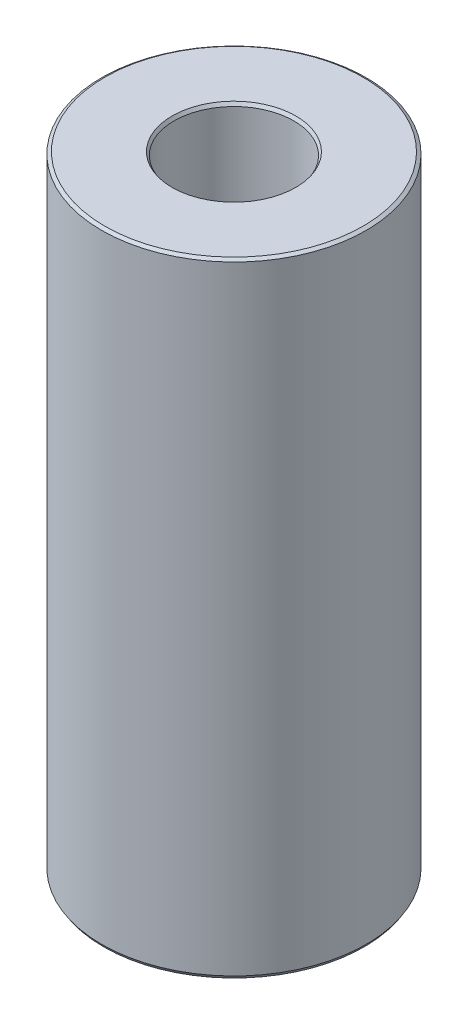
ISO-10303-21;
HEADER;
FILE_DESCRIPTION(('STEP AP214'),'2;1');
FILE_NAME('part.step','',(''),(''),'','','');
FILE_SCHEMA(('AUTOMOTIVE_DESIGN { 1 0 10303 214 1 1 1 1 }'));
ENDSEC;
DATA;
#1=APPLICATION_CONTEXT('core data for automotive mechanical design processes');
#2=APPLICATION_PROTOCOL_DEFINITION('international standard','automotive_design',2000,#1);
#3=PRODUCT_CONTEXT('',#1,'mechanical');
#4=PRODUCT('Part','Part','',(#3));
#5=PRODUCT_RELATED_PRODUCT_CATEGORY('part','',(#4));
#6=PRODUCT_DEFINITION_FORMATION('','',#4);
#7=PRODUCT_DEFINITION_CONTEXT('part definition',#1,'design');
#8=PRODUCT_DEFINITION('design','',#6,#7);
#9=PRODUCT_DEFINITION_SHAPE('','',#8);
#10=(LENGTH_UNIT() NAMED_UNIT(*) SI_UNIT(.MILLI.,.METRE.));
#11=(NAMED_UNIT(*) PLANE_ANGLE_UNIT() SI_UNIT($,.RADIAN.));
#12=(NAMED_UNIT(*) SI_UNIT($,.STERADIAN.) SOLID_ANGLE_UNIT());
#13=UNCERTAINTY_MEASURE_WITH_UNIT(LENGTH_MEASURE(1.E-05),#10,'distance_accuracy_value','');
#14=(GEOMETRIC_REPRESENTATION_CONTEXT(3) GLOBAL_UNCERTAINTY_ASSIGNED_CONTEXT((#13)) GLOBAL_UNIT_ASSIGNED_CONTEXT((#10,
#11,#12)) REPRESENTATION_CONTEXT('',''));
#15=CARTESIAN_POINT('',(0.,0.,0.));
#16=DIRECTION('',(0.,0.,1.));
#17=DIRECTION('',(1.,0.,0.));
#18=AXIS2_PLACEMENT_3D('',#15,#16,#17);
#19=CARTESIAN_POINT('',(0.,282.779953126256,0.));
#20=DIRECTION('',(0.,-1.,0.));
#21=DIRECTION('',(0.,0.,-1.));
#22=AXIS2_PLACEMENT_3D('',#19,#20,#21);
#23=CYLINDRICAL_SURFACE('',#22,60.);
#24=CARTESIAN_POINT('',(0.,1.45404582667269,0.));
#25=DIRECTION('',(0.,1.,0.));
#26=DIRECTION('',(0.,0.,1.));
#27=AXIS2_PLACEMENT_3D('',#24,#25,#26);
#28=CIRCLE('',#27,60.);
#29=CARTESIAN_POINT('',(0.,1.45404582667269,60.));
#30=VERTEX_POINT('',#29);
#31=EDGE_CURVE('E10',#30,#30,#28,.T.);
#32=ORIENTED_EDGE('',*,*,#31,.T.);
#33=EDGE_LOOP('',(#32));
#34=FACE_BOUND('',#33,.T.);
#35=CARTESIAN_POINT('',(0.,281.864798766686,0.));
#36=DIRECTION('',(0.,1.,0.));
#37=DIRECTION('',(0.,0.,1.));
#38=AXIS2_PLACEMENT_3D('',#35,#36,#37);
#39=CIRCLE('',#38,60.);
#40=CARTESIAN_POINT('',(0.,281.864798766686,60.));
#41=VERTEX_POINT('',#40);
#42=EDGE_CURVE('E50',#41,#41,#39,.F.);
#43=ORIENTED_EDGE('',*,*,#42,.T.);
#44=EDGE_LOOP('',(#43));
#45=FACE_BOUND('',#44,.T.);
#46=ADVANCED_FACE('F39',(#34,#45),#23,.T.);
#47=CARTESIAN_POINT('',(0.,282.779953126256,0.));
#48=DIRECTION('',(0.,1.,0.));
#49=DIRECTION('',(0.,0.,1.));
#50=AXIS2_PLACEMENT_3D('',#47,#48,#49);
#51=PLANE('',#50);
#52=CARTESIAN_POINT('',(0.,282.779953126256,0.));
#53=DIRECTION('',(0.,1.,0.));
#54=DIRECTION('',(0.,0.,1.));
#55=AXIS2_PLACEMENT_3D('',#52,#53,#54);
#56=CIRCLE('',#55,28.0710831644556);
#57=CARTESIAN_POINT('',(0.,282.779953126256,28.0710831644556));
#58=VERTEX_POINT('',#57);
#59=EDGE_CURVE('E58',#58,#58,#56,.F.);
#60=ORIENTED_EDGE('',*,*,#59,.T.);
#61=EDGE_LOOP('',(#60));
#62=FACE_BOUND('',#61,.T.);
#63=CARTESIAN_POINT('',(0.,282.779953126256,0.));
#64=DIRECTION('',(0.,1.,0.));
#65=DIRECTION('',(0.,0.,1.));
#66=AXIS2_PLACEMENT_3D('',#63,#64,#65);
#67=CIRCLE('',#66,58.5459541733271);
#68=CARTESIAN_POINT('',(0.,282.779953126256,58.5459541733271));
#69=VERTEX_POINT('',#68);
#70=EDGE_CURVE('E61',#69,#69,#67,.T.);
#71=ORIENTED_EDGE('',*,*,#70,.T.);
#72=EDGE_LOOP('',(#71));
#73=FACE_BOUND('',#72,.T.);
#74=ADVANCED_FACE('F88',(#62,#73),#51,.T.);
#75=CARTESIAN_POINT('',(0.,0.,0.));
#76=DIRECTION('',(0.,1.,0.));
#77=DIRECTION('',(0.,0.,1.));
#78=AXIS2_PLACEMENT_3D('',#75,#76,#77);
#79=PLANE('',#78);
#80=CARTESIAN_POINT('',(0.,0.,0.));
#81=DIRECTION('',(0.,1.,0.));
#82=DIRECTION('',(0.,0.,1.));
#83=AXIS2_PLACEMENT_3D('',#80,#81,#82);
#84=CIRCLE('',#83,28.6099746315583);
#85=CARTESIAN_POINT('',(0.,0.,28.6099746315583));
#86=VERTEX_POINT('',#85);
#87=EDGE_CURVE('E51',#86,#86,#84,.T.);
#88=ORIENTED_EDGE('',*,*,#87,.T.);
#89=EDGE_LOOP('',(#88));
#90=FACE_BOUND('',#89,.T.);
#91=CARTESIAN_POINT('',(0.,0.,0.));
#92=DIRECTION('',(0.,1.,0.));
#93=DIRECTION('',(0.,0.,1.));
#94=AXIS2_PLACEMENT_3D('',#91,#92,#93);
#95=CIRCLE('',#94,59.0848456404301);
#96=CARTESIAN_POINT('',(0.,0.,59.0848456404301));
#97=VERTEX_POINT('',#96);
#98=EDGE_CURVE('E54',#97,#97,#95,.F.);
#99=ORIENTED_EDGE('',*,*,#98,.T.);
#100=EDGE_LOOP('',(#99));
#101=FACE_BOUND('',#100,.T.);
#102=ADVANCED_FACE('F83',(#90,#101),#79,.F.);
#103=CARTESIAN_POINT('',(0.,282.779953126256,0.));
#104=DIRECTION('',(0.,-1.,0.));
#105=DIRECTION('',(0.,0.,-1.));
#106=AXIS2_PLACEMENT_3D('',#103,#104,#105);
#107=CYLINDRICAL_SURFACE('',#106,27.1559288048855);
#108=CARTESIAN_POINT('',(0.,281.325907299584,0.));
#109=DIRECTION('',(0.,1.,0.));
#110=DIRECTION('',(0.,0.,1.));
#111=AXIS2_PLACEMENT_3D('',#108,#109,#110);
#112=CIRCLE('',#111,27.1559288048855);
#113=CARTESIAN_POINT('',(0.,281.325907299584,27.1559288048855));
#114=VERTEX_POINT('',#113);
#115=EDGE_CURVE('E67',#114,#114,#112,.T.);
#116=ORIENTED_EDGE('',*,*,#115,.T.);
#117=EDGE_LOOP('',(#116));
#118=FACE_BOUND('',#117,.T.);
#119=CARTESIAN_POINT('',(0.,0.915154359570014,0.));
#120=DIRECTION('',(0.,1.,0.));
#121=DIRECTION('',(0.,0.,1.));
#122=AXIS2_PLACEMENT_3D('',#119,#120,#121);
#123=CIRCLE('',#122,27.1559288048855);
#124=CARTESIAN_POINT('',(0.,0.915154359570014,27.1559288048855));
#125=VERTEX_POINT('',#124);
#126=EDGE_CURVE('E69',#125,#125,#123,.F.);
#127=ORIENTED_EDGE('',*,*,#126,.T.);
#128=EDGE_LOOP('',(#127));
#129=FACE_BOUND('',#128,.T.);
#130=ADVANCED_FACE('F71',(#118,#129),#107,.F.);
#131=CARTESIAN_POINT('',(0.,281.325907299584,0.));
#132=DIRECTION('',(0.,1.,0.));
#133=DIRECTION('',(0.,0.,1.));
#134=AXIS2_PLACEMENT_3D('',#131,#132,#133);
#135=CONICAL_SURFACE('',#134,27.1559288048855,0.561746226699516);
#136=ORIENTED_EDGE('',*,*,#59,.F.);
#137=EDGE_LOOP('',(#136));
#138=FACE_BOUND('',#137,.T.);
#139=ORIENTED_EDGE('',*,*,#115,.F.);
#140=EDGE_LOOP('',(#139));
#141=FACE_BOUND('',#140,.T.);
#142=ADVANCED_FACE('F77',(#138,#141),#135,.F.);
#143=CARTESIAN_POINT('',(0.,0.,0.));
#144=DIRECTION('',(0.,-1.,0.));
#145=DIRECTION('',(0.,0.,-1.));
#146=AXIS2_PLACEMENT_3D('',#143,#144,#145);
#147=CONICAL_SURFACE('',#146,28.6099746315583,1.00905010009537);
#148=ORIENTED_EDGE('',*,*,#126,.F.);
#149=EDGE_LOOP('',(#148));
#150=FACE_BOUND('',#149,.T.);
#151=ORIENTED_EDGE('',*,*,#87,.F.);
#152=EDGE_LOOP('',(#151));
#153=FACE_BOUND('',#152,.T.);
#154=ADVANCED_FACE('F73',(#150,#153),#147,.F.);
#155=CARTESIAN_POINT('',(0.,1.45404582667269,0.));
#156=DIRECTION('',(0.,1.,0.));
#157=DIRECTION('',(0.,0.,1.));
#158=AXIS2_PLACEMENT_3D('',#155,#156,#157);
#159=CONICAL_SURFACE('',#158,60.,0.561746226699502);
#160=CARTESIAN_POINT('',(0.,0.,59.0848456404301));
#161=CARTESIAN_POINT('',(0.,0.0151463106945052,59.0943784983423));
#162=CARTESIAN_POINT('',(0.,0.030292621389013,59.1039113562545));
#163=CARTESIAN_POINT('',(0.,0.0605852427780286,59.1229770720788));
#164=CARTESIAN_POINT('',(0.,0.0757315534725364,59.132509929991));
#165=CARTESIAN_POINT('',(0.,0.10602417486155,59.1515756458154));
#166=CARTESIAN_POINT('',(0.,0.121170485556057,59.1611085037276));
#167=CARTESIAN_POINT('',(0.,0.151463106945071,59.180174219552));
#168=CARTESIAN_POINT('',(0.,0.166609417639579,59.1897070774641));
#169=CARTESIAN_POINT('',(0.,0.196902039028594,59.2087727932885));
#170=CARTESIAN_POINT('',(0.,0.2120483497231,59.2183056512007));
#171=CARTESIAN_POINT('',(0.,0.242340971112114,59.2373713670251));
#172=CARTESIAN_POINT('',(0.,0.257487281806622,59.2469042249373));
#173=CARTESIAN_POINT('',(0.,0.287779903195637,59.2659699407616));
#174=CARTESIAN_POINT('',(0.,0.302926213890143,59.2755027986738));
#175=CARTESIAN_POINT('',(0.,0.333218835279157,59.2945685144982));
#176=CARTESIAN_POINT('',(0.,0.348365145973665,59.3041013724104));
#177=CARTESIAN_POINT('',(0.,0.37865776736268,59.3231670882347));
#178=CARTESIAN_POINT('',(0.,0.393804078057187,59.3326999461469));
#179=CARTESIAN_POINT('',(0.,0.424096699446201,59.3517656619713));
#180=CARTESIAN_POINT('',(0.,0.439243010140707,59.3612985198835));
#181=CARTESIAN_POINT('',(0.,0.469535631529722,59.3803642357079));
#182=CARTESIAN_POINT('',(0.,0.48468194222423,59.38989709362));
#183=CARTESIAN_POINT('',(0.,0.514974563613244,59.4089628094444));
#184=CARTESIAN_POINT('',(0.,0.530120874307751,59.4184956673566));
#185=CARTESIAN_POINT('',(0.,0.560413495696765,59.437561383181));
#186=CARTESIAN_POINT('',(0.,0.575559806391273,59.4470942410932));
#187=CARTESIAN_POINT('',(0.,0.605852427780288,59.4661599569175));
#188=CARTESIAN_POINT('',(0.,0.620998738474794,59.4756928148297));
#189=CARTESIAN_POINT('',(0.,0.651291359863808,59.4947585306541));
#190=CARTESIAN_POINT('',(0.,0.666437670558316,59.5042913885663));
#191=CARTESIAN_POINT('',(0.,0.696730291947331,59.5233571043907));
#192=CARTESIAN_POINT('',(0.,0.711876602641838,59.5328899623029));
#193=CARTESIAN_POINT('',(0.,0.742169224030851,59.5519556781272));
#194=CARTESIAN_POINT('',(0.,0.757315534725358,59.5614885360394));
#195=CARTESIAN_POINT('',(0.,0.787608156114373,59.5805542518638));
#196=CARTESIAN_POINT('',(0.,0.802754466808881,59.590087109776));
#197=CARTESIAN_POINT('',(0.,0.833047088197895,59.6091528256003));
#198=CARTESIAN_POINT('',(0.,0.848193398892402,59.6186856835125));
#199=CARTESIAN_POINT('',(0.,0.878486020281416,59.6377513993369));
#200=CARTESIAN_POINT('',(0.,0.893632330975924,59.6472842572491));
#201=CARTESIAN_POINT('',(0.,0.923924952364939,59.6663499730735));
#202=CARTESIAN_POINT('',(0.,0.939071263059445,59.6758828309857));
#203=CARTESIAN_POINT('',(0.,0.969363884448459,59.69494854681));
#204=CARTESIAN_POINT('',(0.,0.984510195142967,59.7044814047222));
#205=CARTESIAN_POINT('',(0.,1.01480281653198,59.7235471205466));
#206=CARTESIAN_POINT('',(0.,1.02994912722649,59.7330799784588));
#207=CARTESIAN_POINT('',(0.,1.0602417486155,59.7521456942831));
#208=CARTESIAN_POINT('',(0.,1.07538805931001,59.7616785521953));
#209=CARTESIAN_POINT('',(0.,1.10568068069903,59.7807442680197));
#210=CARTESIAN_POINT('',(0.,1.12082699139353,59.7902771259319));
#211=CARTESIAN_POINT('',(0.,1.15111961278255,59.8093428417563));
#212=CARTESIAN_POINT('',(0.,1.16626592347705,59.8188756996685));
#213=CARTESIAN_POINT('',(0.,1.19655854486607,59.8379414154928));
#214=CARTESIAN_POINT('',(0.,1.21170485556058,59.847474273405));
#215=CARTESIAN_POINT('',(0.,1.24199747694959,59.8665399892294));
#216=CARTESIAN_POINT('',(0.,1.2571437876441,59.8760728471416));
#217=CARTESIAN_POINT('',(0.,1.28743640903311,59.8951385629659));
#218=CARTESIAN_POINT('',(0.,1.30258271972762,59.9046714208781));
#219=CARTESIAN_POINT('',(0.,1.33287534111663,59.9237371367025));
#220=CARTESIAN_POINT('',(0.,1.34802165181114,59.9332699946147));
#221=CARTESIAN_POINT('',(0.,1.37831427320015,59.9523357104391));
#222=CARTESIAN_POINT('',(0.,1.39346058389466,59.9618685683512));
#223=CARTESIAN_POINT('',(0.,1.42375320528368,59.9809342841756));
#224=CARTESIAN_POINT('',(0.,1.43889951597818,59.9904671420878));
#225=CARTESIAN_POINT('',(0.,1.45404582667269,60.));
#226=B_SPLINE_CURVE_WITH_KNOTS('',3,(#160,#161,#162,#163,#164,#165,#166,#167,#168,#169,#170,
#171,#172,#173,#174,#175,#176,#177,#178,#179,#180,#181,#182,#183,#184,#185,#186,#187,#188,#189,
#190,#191,#192,#193,#194,#195,#196,#197,#198,#199,#200,#201,#202,#203,#204,#205,#206,#207,#208,
#209,#210,#211,#212,#213,#214,#215,#216,#217,#218,#219,#220,#221,#222,#223,#224,#225),
.UNSPECIFIED.,.F.,.F.,(4,2,2,2,2,2,2,2,2,2,2,2,2,2,2,2,2,2,2,2,2,2,2,2,2,2,2,2,2,2,2,2,4),(0.,
0.0536896169539001,0.107379233907796,0.161068850861696,0.214758467815593,0.268448084769493,
0.322137701723389,0.375827318677289,0.429516935631186,0.483206552585086,0.536896169538986,
0.590585786492882,0.644275403446782,0.697965020400679,0.751654637354579,0.805344254308475,
0.859033871262375,0.912723488216275,0.966413105170172,1.02010272212407,1.07379233907797,
1.12748195603187,1.18117157298576,1.23486118993966,1.28855080689356,1.34224042384746,
1.39593004080136,1.44961965775526,1.50330927470916,1.55699889166305,1.61068850861695,
1.66437812557085,1.71806774252475),.UNSPECIFIED.);
#227=EDGE_CURVE('BSEAM76',#97,#30,#226,.T.);
#228=ORIENTED_EDGE('',*,*,#98,.F.);
#229=ORIENTED_EDGE('',*,*,#31,.F.);
#230=ORIENTED_EDGE('',*,*,#227,.T.);
#231=ORIENTED_EDGE('',*,*,#227,.F.);
#232=EDGE_LOOP('',(#228,#230,#229,#231));
#233=FACE_BOUND('',#232,.T.);
#234=ADVANCED_FACE('F76',(#233),#159,.T.);
#235=CARTESIAN_POINT('',(0.,282.779953126256,0.));
#236=DIRECTION('',(0.,-1.,0.));
#237=DIRECTION('',(0.,0.,-1.));
#238=AXIS2_PLACEMENT_3D('',#235,#236,#237);
#239=CONICAL_SURFACE('',#238,58.5459541733271,1.00905010009537);
#240=ORIENTED_EDGE('',*,*,#42,.F.);
#241=EDGE_LOOP('',(#240));
#242=FACE_BOUND('',#241,.T.);
#243=ORIENTED_EDGE('',*,*,#70,.F.);
#244=EDGE_LOOP('',(#243));
#245=FACE_BOUND('',#244,.T.);
#246=ADVANCED_FACE('F45',(#242,#245),#239,.T.);
#247=CLOSED_SHELL('',(#46,#74,#102,#130,#142,#154,#234,#246));
#248=MANIFOLD_SOLID_BREP('B2',#247);
#249=ADVANCED_BREP_SHAPE_REPRESENTATION('',(#18,#248),#14);
#250=SHAPE_DEFINITION_REPRESENTATION(#9,#249);
ENDSEC;
END-ISO-10303-21;
